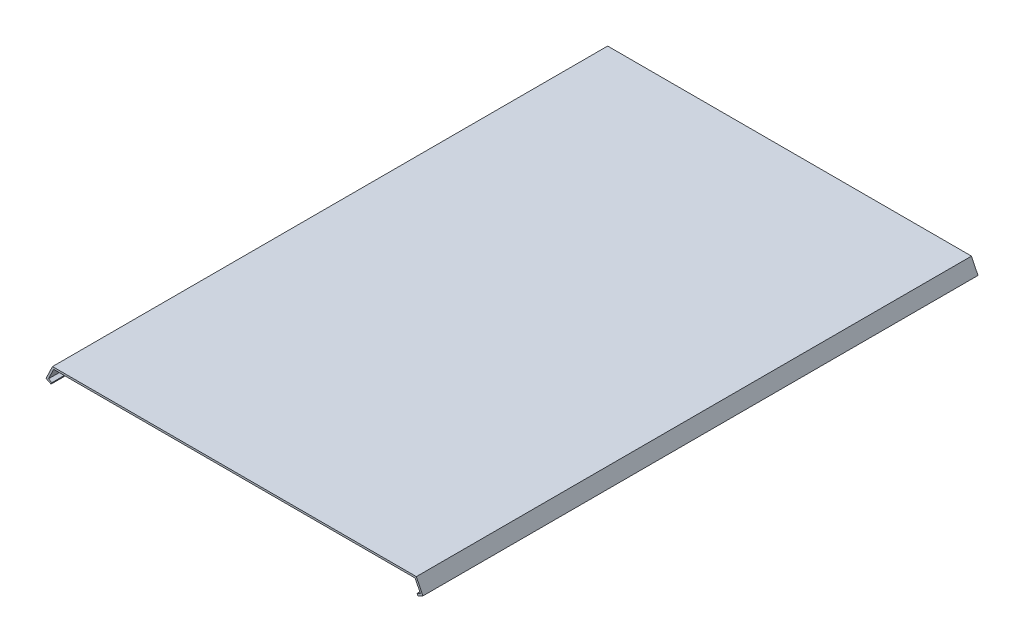
ISO-10303-21;
HEADER;
FILE_DESCRIPTION(('STEP AP214'),'2;1');
FILE_NAME('part.step','',(''),(''),'','','');
FILE_SCHEMA(('AUTOMOTIVE_DESIGN { 1 0 10303 214 1 1 1 1 }'));
ENDSEC;
DATA;
#1=APPLICATION_CONTEXT('core data for automotive mechanical design processes');
#2=APPLICATION_PROTOCOL_DEFINITION('international standard','automotive_design',2000,#1);
#3=PRODUCT_CONTEXT('',#1,'mechanical');
#4=PRODUCT('Part','Part','',(#3));
#5=PRODUCT_RELATED_PRODUCT_CATEGORY('part','',(#4));
#6=PRODUCT_DEFINITION_FORMATION('','',#4);
#7=PRODUCT_DEFINITION_CONTEXT('part definition',#1,'design');
#8=PRODUCT_DEFINITION('design','',#6,#7);
#9=PRODUCT_DEFINITION_SHAPE('','',#8);
#10=(LENGTH_UNIT() NAMED_UNIT(*) SI_UNIT(.MILLI.,.METRE.));
#11=(NAMED_UNIT(*) PLANE_ANGLE_UNIT() SI_UNIT($,.RADIAN.));
#12=(NAMED_UNIT(*) SI_UNIT($,.STERADIAN.) SOLID_ANGLE_UNIT());
#13=UNCERTAINTY_MEASURE_WITH_UNIT(LENGTH_MEASURE(1.E-05),#10,'distance_accuracy_value','');
#14=(GEOMETRIC_REPRESENTATION_CONTEXT(3) GLOBAL_UNCERTAINTY_ASSIGNED_CONTEXT((#13)) GLOBAL_UNIT_ASSIGNED_CONTEXT((#10,
#11,#12)) REPRESENTATION_CONTEXT('',''));
#15=CARTESIAN_POINT('',(0.,0.,0.));
#16=DIRECTION('',(0.,0.,1.));
#17=DIRECTION('',(1.,0.,0.));
#18=AXIS2_PLACEMENT_3D('',#15,#16,#17);
#19=CARTESIAN_POINT('',(97.0000000000001,0.,148.));
#20=DIRECTION('',(0.,-1.,0.));
#21=DIRECTION('',(1.,0.,0.));
#22=AXIS2_PLACEMENT_3D('',#19,#20,#21);
#23=PLANE('',#22);
#24=DIRECTION('',(-1.,0.,0.));
#25=VECTOR('',#24,1.);
#26=CARTESIAN_POINT('',(97.0000000000001,0.,-148.));
#27=LINE('',#26,#25);
#28=CARTESIAN_POINT('',(97.0000000000001,0.,-148.));
#29=VERTEX_POINT('',#28);
#30=CARTESIAN_POINT('',(-96.9999999999999,0.,-148.));
#31=VERTEX_POINT('',#30);
#32=EDGE_CURVE('E125',#29,#31,#27,.T.);
#33=ORIENTED_EDGE('',*,*,#32,.T.);
#34=DIRECTION('',(0.,0.,-1.));
#35=VECTOR('',#34,1.);
#36=CARTESIAN_POINT('',(-96.9999999999999,0.,148.));
#37=LINE('',#36,#35);
#38=CARTESIAN_POINT('',(-96.9999999999999,0.,148.));
#39=VERTEX_POINT('',#38);
#40=EDGE_CURVE('E11',#39,#31,#37,.T.);
#41=ORIENTED_EDGE('',*,*,#40,.F.);
#42=DIRECTION('',(-1.,0.,0.));
#43=VECTOR('',#42,1.);
#44=CARTESIAN_POINT('',(97.0000000000001,0.,148.));
#45=LINE('',#44,#43);
#46=CARTESIAN_POINT('',(97.0000000000001,0.,148.));
#47=VERTEX_POINT('',#46);
#48=EDGE_CURVE('E160',#47,#39,#45,.T.);
#49=ORIENTED_EDGE('',*,*,#48,.F.);
#50=DIRECTION('',(0.,0.,-1.));
#51=VECTOR('',#50,1.);
#52=CARTESIAN_POINT('',(97.0000000000001,0.,148.));
#53=LINE('',#52,#51);
#54=EDGE_CURVE('E138',#47,#29,#53,.T.);
#55=ORIENTED_EDGE('',*,*,#54,.T.);
#56=EDGE_LOOP('',(#33,#41,#49,#55));
#57=FACE_BOUND('',#56,.T.);
#58=ADVANCED_FACE('F33',(#57),#23,.F.);
#59=CARTESIAN_POINT('',(-96.9999999999999,0.,148.));
#60=DIRECTION('',(0.900928178580764,-0.433968221231862,0.));
#61=DIRECTION('',(0.433968221231862,0.900928178580764,0.));
#62=AXIS2_PLACEMENT_3D('',#59,#60,#61);
#63=PLANE('',#62);
#64=DIRECTION('',(-0.433968221231862,-0.900928178580764,0.));
#65=VECTOR('',#64,1.);
#66=CARTESIAN_POINT('',(-96.9999999999999,0.,-148.));
#67=LINE('',#66,#65);
#68=CARTESIAN_POINT('',(-100.471745769855,-7.20742542864627,-148.));
#69=VERTEX_POINT('',#68);
#70=EDGE_CURVE('E121',#31,#69,#67,.T.);
#71=ORIENTED_EDGE('',*,*,#70,.T.);
#72=DIRECTION('',(0.,0.,-1.));
#73=VECTOR('',#72,1.);
#74=CARTESIAN_POINT('',(-100.471745769855,-7.20742542864627,148.));
#75=LINE('',#74,#73);
#76=CARTESIAN_POINT('',(-100.471745769855,-7.20742542864627,148.));
#77=VERTEX_POINT('',#76);
#78=EDGE_CURVE('E40',#77,#69,#75,.T.);
#79=ORIENTED_EDGE('',*,*,#78,.F.);
#80=DIRECTION('',(-0.433968221231862,-0.900928178580764,0.));
#81=VECTOR('',#80,1.);
#82=CARTESIAN_POINT('',(-96.9999999999999,0.,148.));
#83=LINE('',#82,#81);
#84=EDGE_CURVE('E134',#39,#77,#83,.T.);
#85=ORIENTED_EDGE('',*,*,#84,.F.);
#86=ORIENTED_EDGE('',*,*,#40,.T.);
#87=EDGE_LOOP('',(#71,#79,#85,#86));
#88=FACE_BOUND('',#87,.T.);
#89=ADVANCED_FACE('F133',(#88),#63,.F.);
#90=CARTESIAN_POINT('',(-100.471745769855,-7.20742542864627,148.));
#91=DIRECTION('',(0.433968221231814,0.900928178580788,0.));
#92=DIRECTION('',(-0.900928178580788,0.433968221231814,0.));
#93=AXIS2_PLACEMENT_3D('',#90,#91,#92);
#94=PLANE('',#93);
#95=DIRECTION('',(0.900928178580788,-0.433968221231814,0.));
#96=VECTOR('',#95,1.);
#97=CARTESIAN_POINT('',(-100.471745769855,-7.20742542864627,-148.));
#98=LINE('',#97,#96);
#99=CARTESIAN_POINT('',(-97.7689612341136,-8.50933009234118,-148.));
#100=VERTEX_POINT('',#99);
#101=EDGE_CURVE('E127',#69,#100,#98,.T.);
#102=ORIENTED_EDGE('',*,*,#101,.T.);
#103=DIRECTION('',(0.,0.,-1.));
#104=VECTOR('',#103,1.);
#105=CARTESIAN_POINT('',(-97.7689612341136,-8.50933009234118,148.));
#106=LINE('',#105,#104);
#107=CARTESIAN_POINT('',(-97.7689612341136,-8.50933009234118,148.));
#108=VERTEX_POINT('',#107);
#109=EDGE_CURVE('E206',#108,#100,#106,.T.);
#110=ORIENTED_EDGE('',*,*,#109,.F.);
#111=DIRECTION('',(0.900928178580788,-0.433968221231814,0.));
#112=VECTOR('',#111,1.);
#113=CARTESIAN_POINT('',(-100.471745769855,-7.20742542864627,148.));
#114=LINE('',#113,#112);
#115=EDGE_CURVE('E163',#77,#108,#114,.T.);
#116=ORIENTED_EDGE('',*,*,#115,.F.);
#117=ORIENTED_EDGE('',*,*,#78,.T.);
#118=EDGE_LOOP('',(#102,#110,#116,#117));
#119=FACE_BOUND('',#118,.T.);
#120=ADVANCED_FACE('F210',(#119),#94,.F.);
#121=CARTESIAN_POINT('',(-97.3349930128817,-7.60840191376042,148.));
#122=DIRECTION('',(-0.900928178580765,0.43396822123186,0.));
#123=DIRECTION('',(-0.43396822123186,-0.900928178580766,0.));
#124=AXIS2_PLACEMENT_3D('',#121,#122,#123);
#125=PLANE('',#124);
#126=DIRECTION('',(0.43396822123186,0.900928178580765,0.));
#127=VECTOR('',#126,1.);
#128=CARTESIAN_POINT('',(-97.3349930128817,-7.60840191376042,-148.));
#129=LINE('',#128,#127);
#130=CARTESIAN_POINT('',(-97.3349930128817,-7.60840191376042,-148.));
#131=VERTEX_POINT('',#130);
#132=EDGE_CURVE('E142',#100,#131,#129,.T.);
#133=ORIENTED_EDGE('',*,*,#132,.T.);
#134=DIRECTION('',(0.,0.,-1.));
#135=VECTOR('',#134,1.);
#136=CARTESIAN_POINT('',(-97.3349930128817,-7.60840191376042,148.));
#137=LINE('',#136,#135);
#138=CARTESIAN_POINT('',(-97.3349930128817,-7.60840191376042,148.));
#139=VERTEX_POINT('',#138);
#140=EDGE_CURVE('E203',#139,#131,#137,.T.);
#141=ORIENTED_EDGE('',*,*,#140,.F.);
#142=DIRECTION('',(0.43396822123186,0.900928178580765,0.));
#143=VECTOR('',#142,1.);
#144=CARTESIAN_POINT('',(-97.3349930128817,-7.60840191376042,148.));
#145=LINE('',#144,#143);
#146=EDGE_CURVE('E165',#108,#139,#145,.T.);
#147=ORIENTED_EDGE('',*,*,#146,.F.);
#148=ORIENTED_EDGE('',*,*,#109,.T.);
#149=EDGE_LOOP('',(#133,#141,#147,#148));
#150=FACE_BOUND('',#149,.T.);
#151=ADVANCED_FACE('F218',(#150),#125,.F.);
#152=CARTESIAN_POINT('',(-99.1368493700422,-6.74046547129717,148.));
#153=DIRECTION('',(-0.433968221231861,-0.900928178580765,0.));
#154=DIRECTION('',(0.900928178580765,-0.433968221231861,0.));
#155=AXIS2_PLACEMENT_3D('',#152,#153,#154);
#156=PLANE('',#155);
#157=DIRECTION('',(-0.900928178580765,0.433968221231861,0.));
#158=VECTOR('',#157,1.);
#159=CARTESIAN_POINT('',(-99.1368493700422,-6.74046547129717,-148.));
#160=LINE('',#159,#158);
#161=CARTESIAN_POINT('',(-99.1368493700422,-6.74046547129717,-148.));
#162=VERTEX_POINT('',#161);
#163=EDGE_CURVE('E144',#131,#162,#160,.T.);
#164=ORIENTED_EDGE('',*,*,#163,.T.);
#165=DIRECTION('',(0.,0.,-1.));
#166=VECTOR('',#165,1.);
#167=CARTESIAN_POINT('',(-99.1368493700422,-6.74046547129717,148.));
#168=LINE('',#167,#166);
#169=CARTESIAN_POINT('',(-99.1368493700422,-6.74046547129717,148.));
#170=VERTEX_POINT('',#169);
#171=EDGE_CURVE('E200',#170,#162,#168,.T.);
#172=ORIENTED_EDGE('',*,*,#171,.F.);
#173=DIRECTION('',(-0.900928178580765,0.433968221231861,0.));
#174=VECTOR('',#173,1.);
#175=CARTESIAN_POINT('',(-99.1368493700422,-6.74046547129717,148.));
#176=LINE('',#175,#174);
#177=EDGE_CURVE('E167',#139,#170,#176,.T.);
#178=ORIENTED_EDGE('',*,*,#177,.F.);
#179=ORIENTED_EDGE('',*,*,#140,.T.);
#180=EDGE_LOOP('',(#164,#172,#178,#179));
#181=FACE_BOUND('',#180,.T.);
#182=ADVANCED_FACE('F221',(#181),#156,.F.);
#183=CARTESIAN_POINT('',(-96.3717237486568,-1.00000000000002,148.));
#184=DIRECTION('',(-0.900928178580764,0.433968221231862,0.));
#185=DIRECTION('',(-0.433968221231862,-0.900928178580764,0.));
#186=AXIS2_PLACEMENT_3D('',#183,#184,#185);
#187=PLANE('',#186);
#188=DIRECTION('',(0.433968221231862,0.900928178580764,0.));
#189=VECTOR('',#188,1.);
#190=CARTESIAN_POINT('',(-96.3717237486568,-1.00000000000002,-148.));
#191=LINE('',#190,#189);
#192=CARTESIAN_POINT('',(-96.3717237486568,-1.00000000000002,-148.));
#193=VERTEX_POINT('',#192);
#194=EDGE_CURVE('E146',#162,#193,#191,.T.);
#195=ORIENTED_EDGE('',*,*,#194,.T.);
#196=DIRECTION('',(0.,0.,-1.));
#197=VECTOR('',#196,1.);
#198=CARTESIAN_POINT('',(-96.3717237486568,-1.00000000000002,148.));
#199=LINE('',#198,#197);
#200=CARTESIAN_POINT('',(-96.3717237486568,-1.00000000000002,148.));
#201=VERTEX_POINT('',#200);
#202=EDGE_CURVE('E197',#201,#193,#199,.T.);
#203=ORIENTED_EDGE('',*,*,#202,.F.);
#204=DIRECTION('',(0.433968221231862,0.900928178580764,0.));
#205=VECTOR('',#204,1.);
#206=CARTESIAN_POINT('',(-96.3717237486568,-1.00000000000002,148.));
#207=LINE('',#206,#205);
#208=EDGE_CURVE('E169',#170,#201,#207,.T.);
#209=ORIENTED_EDGE('',*,*,#208,.F.);
#210=ORIENTED_EDGE('',*,*,#171,.T.);
#211=EDGE_LOOP('',(#195,#203,#209,#210));
#212=FACE_BOUND('',#211,.T.);
#213=ADVANCED_FACE('F226',(#212),#187,.F.);
#214=CARTESIAN_POINT('',(-96.3717237486568,-1.00000000000002,148.));
#215=DIRECTION('',(0.,1.,0.));
#216=DIRECTION('',(-1.,0.,0.));
#217=AXIS2_PLACEMENT_3D('',#214,#215,#216);
#218=PLANE('',#217);
#219=DIRECTION('',(1.,0.,0.));
#220=VECTOR('',#219,1.);
#221=CARTESIAN_POINT('',(-96.3717237486568,-1.00000000000002,-148.));
#222=LINE('',#221,#220);
#223=CARTESIAN_POINT('',(96.3717237486568,-0.999999999999994,-148.));
#224=VERTEX_POINT('',#223);
#225=EDGE_CURVE('E148',#193,#224,#222,.T.);
#226=ORIENTED_EDGE('',*,*,#225,.T.);
#227=DIRECTION('',(0.,0.,-1.));
#228=VECTOR('',#227,1.);
#229=CARTESIAN_POINT('',(96.3717237486568,-0.999999999999994,148.));
#230=LINE('',#229,#228);
#231=CARTESIAN_POINT('',(96.3717237486568,-0.999999999999994,148.));
#232=VERTEX_POINT('',#231);
#233=EDGE_CURVE('E194',#232,#224,#230,.T.);
#234=ORIENTED_EDGE('',*,*,#233,.F.);
#235=DIRECTION('',(1.,0.,0.));
#236=VECTOR('',#235,1.);
#237=CARTESIAN_POINT('',(-96.3717237486568,-1.00000000000002,148.));
#238=LINE('',#237,#236);
#239=EDGE_CURVE('E171',#201,#232,#238,.T.);
#240=ORIENTED_EDGE('',*,*,#239,.F.);
#241=ORIENTED_EDGE('',*,*,#202,.T.);
#242=EDGE_LOOP('',(#226,#234,#240,#241));
#243=FACE_BOUND('',#242,.T.);
#244=ADVANCED_FACE('F232',(#243),#218,.F.);
#245=CARTESIAN_POINT('',(96.3717237486568,-0.999999999999994,148.));
#246=DIRECTION('',(0.900928178580594,0.433968221232215,0.));
#247=DIRECTION('',(-0.433968221232215,0.900928178580594,0.));
#248=AXIS2_PLACEMENT_3D('',#245,#246,#247);
#249=PLANE('',#248);
#250=DIRECTION('',(0.433968221232215,-0.900928178580594,0.));
#251=VECTOR('',#250,1.);
#252=CARTESIAN_POINT('',(96.3717237486568,-0.999999999999994,-148.));
#253=LINE('',#252,#251);
#254=CARTESIAN_POINT('',(99.1368493700447,-6.74046547129655,-148.));
#255=VERTEX_POINT('',#254);
#256=EDGE_CURVE('E150',#224,#255,#253,.T.);
#257=ORIENTED_EDGE('',*,*,#256,.T.);
#258=DIRECTION('',(0.,0.,-1.));
#259=VECTOR('',#258,1.);
#260=CARTESIAN_POINT('',(99.1368493700447,-6.74046547129655,148.));
#261=LINE('',#260,#259);
#262=CARTESIAN_POINT('',(99.1368493700447,-6.74046547129655,148.));
#263=VERTEX_POINT('',#262);
#264=EDGE_CURVE('E191',#263,#255,#261,.T.);
#265=ORIENTED_EDGE('',*,*,#264,.F.);
#266=DIRECTION('',(0.433968221232215,-0.900928178580594,0.));
#267=VECTOR('',#266,1.);
#268=CARTESIAN_POINT('',(96.3717237486568,-0.999999999999994,148.));
#269=LINE('',#268,#267);
#270=EDGE_CURVE('E173',#232,#263,#269,.T.);
#271=ORIENTED_EDGE('',*,*,#270,.F.);
#272=ORIENTED_EDGE('',*,*,#233,.T.);
#273=EDGE_LOOP('',(#257,#265,#271,#272));
#274=FACE_BOUND('',#273,.T.);
#275=ADVANCED_FACE('F236',(#274),#249,.F.);
#276=CARTESIAN_POINT('',(99.1368493700447,-6.74046547129655,148.));
#277=DIRECTION('',(0.433968221232222,-0.900928178580591,0.));
#278=DIRECTION('',(0.900928178580591,0.433968221232222,0.));
#279=AXIS2_PLACEMENT_3D('',#276,#277,#278);
#280=PLANE('',#279);
#281=DIRECTION('',(-0.900928178580591,-0.433968221232222,0.));
#282=VECTOR('',#281,1.);
#283=CARTESIAN_POINT('',(99.1368493700447,-6.74046547129655,-148.));
#284=LINE('',#283,#282);
#285=CARTESIAN_POINT('',(97.3349930128849,-7.60840191376031,-148.));
#286=VERTEX_POINT('',#285);
#287=EDGE_CURVE('E152',#255,#286,#284,.T.);
#288=ORIENTED_EDGE('',*,*,#287,.T.);
#289=DIRECTION('',(0.,0.,-1.));
#290=VECTOR('',#289,1.);
#291=CARTESIAN_POINT('',(97.3349930128849,-7.60840191376031,148.));
#292=LINE('',#291,#290);
#293=CARTESIAN_POINT('',(97.3349930128849,-7.60840191376031,148.));
#294=VERTEX_POINT('',#293);
#295=EDGE_CURVE('E188',#294,#286,#292,.T.);
#296=ORIENTED_EDGE('',*,*,#295,.F.);
#297=DIRECTION('',(-0.900928178580591,-0.433968221232222,0.));
#298=VECTOR('',#297,1.);
#299=CARTESIAN_POINT('',(99.1368493700447,-6.74046547129655,148.));
#300=LINE('',#299,#298);
#301=EDGE_CURVE('E175',#263,#294,#300,.T.);
#302=ORIENTED_EDGE('',*,*,#301,.F.);
#303=ORIENTED_EDGE('',*,*,#264,.T.);
#304=EDGE_LOOP('',(#288,#296,#302,#303));
#305=FACE_BOUND('',#304,.T.);
#306=ADVANCED_FACE('F241',(#305),#280,.F.);
#307=CARTESIAN_POINT('',(97.3349930128849,-7.60840191376031,148.));
#308=DIRECTION('',(0.900928178580589,0.433968221232225,0.));
#309=DIRECTION('',(-0.433968221232225,0.900928178580589,0.));
#310=AXIS2_PLACEMENT_3D('',#307,#308,#309);
#311=PLANE('',#310);
#312=DIRECTION('',(0.433968221232225,-0.900928178580589,0.));
#313=VECTOR('',#312,1.);
#314=CARTESIAN_POINT('',(97.3349930128849,-7.60840191376031,-148.));
#315=LINE('',#314,#313);
#316=CARTESIAN_POINT('',(97.7689612341171,-8.50933009234089,-148.));
#317=VERTEX_POINT('',#316);
#318=EDGE_CURVE('E154',#286,#317,#315,.T.);
#319=ORIENTED_EDGE('',*,*,#318,.T.);
#320=DIRECTION('',(0.,0.,-1.));
#321=VECTOR('',#320,1.);
#322=CARTESIAN_POINT('',(97.7689612341171,-8.50933009234089,148.));
#323=LINE('',#322,#321);
#324=CARTESIAN_POINT('',(97.7689612341171,-8.50933009234089,148.));
#325=VERTEX_POINT('',#324);
#326=EDGE_CURVE('E185',#325,#317,#323,.T.);
#327=ORIENTED_EDGE('',*,*,#326,.F.);
#328=DIRECTION('',(0.433968221232225,-0.900928178580589,0.));
#329=VECTOR('',#328,1.);
#330=CARTESIAN_POINT('',(97.3349930128849,-7.60840191376031,148.));
#331=LINE('',#330,#329);
#332=EDGE_CURVE('E177',#294,#325,#331,.T.);
#333=ORIENTED_EDGE('',*,*,#332,.F.);
#334=ORIENTED_EDGE('',*,*,#295,.T.);
#335=EDGE_LOOP('',(#319,#327,#333,#334));
#336=FACE_BOUND('',#335,.T.);
#337=ADVANCED_FACE('F245',(#336),#311,.F.);
#338=CARTESIAN_POINT('',(97.7689612341171,-8.50933009234089,148.));
#339=DIRECTION('',(-0.433968221232215,0.900928178580595,0.));
#340=DIRECTION('',(-0.900928178580595,-0.433968221232215,0.));
#341=AXIS2_PLACEMENT_3D('',#338,#339,#340);
#342=PLANE('',#341);
#343=DIRECTION('',(0.900928178580594,0.433968221232214,0.));
#344=VECTOR('',#343,1.);
#345=CARTESIAN_POINT('',(97.7689612341171,-8.50933009234089,-148.));
#346=LINE('',#345,#344);
#347=CARTESIAN_POINT('',(100.471745769858,-7.20742542864476,-148.));
#348=VERTEX_POINT('',#347);
#349=EDGE_CURVE('E156',#317,#348,#346,.T.);
#350=ORIENTED_EDGE('',*,*,#349,.T.);
#351=DIRECTION('',(0.,0.,-1.));
#352=VECTOR('',#351,1.);
#353=CARTESIAN_POINT('',(100.471745769858,-7.20742542864476,148.));
#354=LINE('',#353,#352);
#355=CARTESIAN_POINT('',(100.471745769858,-7.20742542864476,148.));
#356=VERTEX_POINT('',#355);
#357=EDGE_CURVE('E182',#356,#348,#354,.T.);
#358=ORIENTED_EDGE('',*,*,#357,.F.);
#359=DIRECTION('',(0.900928178580594,0.433968221232214,0.));
#360=VECTOR('',#359,1.);
#361=CARTESIAN_POINT('',(97.7689612341171,-8.50933009234089,148.));
#362=LINE('',#361,#360);
#363=EDGE_CURVE('E52',#325,#356,#362,.T.);
#364=ORIENTED_EDGE('',*,*,#363,.F.);
#365=ORIENTED_EDGE('',*,*,#326,.T.);
#366=EDGE_LOOP('',(#350,#358,#364,#365));
#367=FACE_BOUND('',#366,.T.);
#368=ADVANCED_FACE('F249',(#367),#342,.F.);
#369=CARTESIAN_POINT('',(100.471745769858,-7.20742542864476,148.));
#370=DIRECTION('',(-0.900928178580595,-0.433968221232215,0.));
#371=DIRECTION('',(0.433968221232215,-0.900928178580595,0.));
#372=AXIS2_PLACEMENT_3D('',#369,#370,#371);
#373=PLANE('',#372);
#374=DIRECTION('',(-0.433968221232215,0.900928178580594,0.));
#375=VECTOR('',#374,1.);
#376=CARTESIAN_POINT('',(100.471745769858,-7.20742542864476,-148.));
#377=LINE('',#376,#375);
#378=EDGE_CURVE('E158',#348,#29,#377,.T.);
#379=ORIENTED_EDGE('',*,*,#378,.T.);
#380=ORIENTED_EDGE('',*,*,#54,.F.);
#381=DIRECTION('',(-0.433968221232215,0.900928178580594,0.));
#382=VECTOR('',#381,1.);
#383=CARTESIAN_POINT('',(100.471745769858,-7.20742542864476,148.));
#384=LINE('',#383,#382);
#385=EDGE_CURVE('E47',#356,#47,#384,.T.);
#386=ORIENTED_EDGE('',*,*,#385,.F.);
#387=ORIENTED_EDGE('',*,*,#357,.T.);
#388=EDGE_LOOP('',(#379,#380,#386,#387));
#389=FACE_BOUND('',#388,.T.);
#390=ADVANCED_FACE('F251',(#389),#373,.F.);
#391=CARTESIAN_POINT('',(-93.6701008234366,0.,148.));
#392=DIRECTION('',(0.,0.,1.));
#393=DIRECTION('',(1.,0.,0.));
#394=AXIS2_PLACEMENT_3D('',#391,#392,#393);
#395=PLANE('',#394);
#396=ORIENTED_EDGE('',*,*,#48,.T.);
#397=ORIENTED_EDGE('',*,*,#84,.T.);
#398=ORIENTED_EDGE('',*,*,#115,.T.);
#399=ORIENTED_EDGE('',*,*,#146,.T.);
#400=ORIENTED_EDGE('',*,*,#177,.T.);
#401=ORIENTED_EDGE('',*,*,#208,.T.);
#402=ORIENTED_EDGE('',*,*,#239,.T.);
#403=ORIENTED_EDGE('',*,*,#270,.T.);
#404=ORIENTED_EDGE('',*,*,#301,.T.);
#405=ORIENTED_EDGE('',*,*,#332,.T.);
#406=ORIENTED_EDGE('',*,*,#363,.T.);
#407=ORIENTED_EDGE('',*,*,#385,.T.);
#408=EDGE_LOOP('',(#396,#397,#398,#399,#400,#401,#402,#403,#404,#405,#406,#407));
#409=FACE_BOUND('',#408,.T.);
#410=ADVANCED_FACE('F213',(#409),#395,.T.);
#411=CARTESIAN_POINT('',(-93.6701008234366,0.,-148.));
#412=DIRECTION('',(0.,0.,1.));
#413=DIRECTION('',(1.,0.,0.));
#414=AXIS2_PLACEMENT_3D('',#411,#412,#413);
#415=PLANE('',#414);
#416=ORIENTED_EDGE('',*,*,#32,.F.);
#417=ORIENTED_EDGE('',*,*,#378,.F.);
#418=ORIENTED_EDGE('',*,*,#349,.F.);
#419=ORIENTED_EDGE('',*,*,#318,.F.);
#420=ORIENTED_EDGE('',*,*,#287,.F.);
#421=ORIENTED_EDGE('',*,*,#256,.F.);
#422=ORIENTED_EDGE('',*,*,#225,.F.);
#423=ORIENTED_EDGE('',*,*,#194,.F.);
#424=ORIENTED_EDGE('',*,*,#163,.F.);
#425=ORIENTED_EDGE('',*,*,#132,.F.);
#426=ORIENTED_EDGE('',*,*,#101,.F.);
#427=ORIENTED_EDGE('',*,*,#70,.F.);
#428=EDGE_LOOP('',(#416,#417,#418,#419,#420,#421,#422,#423,#424,#425,#426,#427));
#429=FACE_BOUND('',#428,.T.);
#430=ADVANCED_FACE('F122',(#429),#415,.F.);
#431=CLOSED_SHELL('',(#58,#89,#120,#151,#182,#213,#244,#275,#306,#337,#368,#390,#410,#430));
#432=MANIFOLD_SOLID_BREP('B2',#431);
#433=ADVANCED_BREP_SHAPE_REPRESENTATION('',(#18,#432),#14);
#434=SHAPE_DEFINITION_REPRESENTATION(#9,#433);
ENDSEC;
END-ISO-10303-21;
